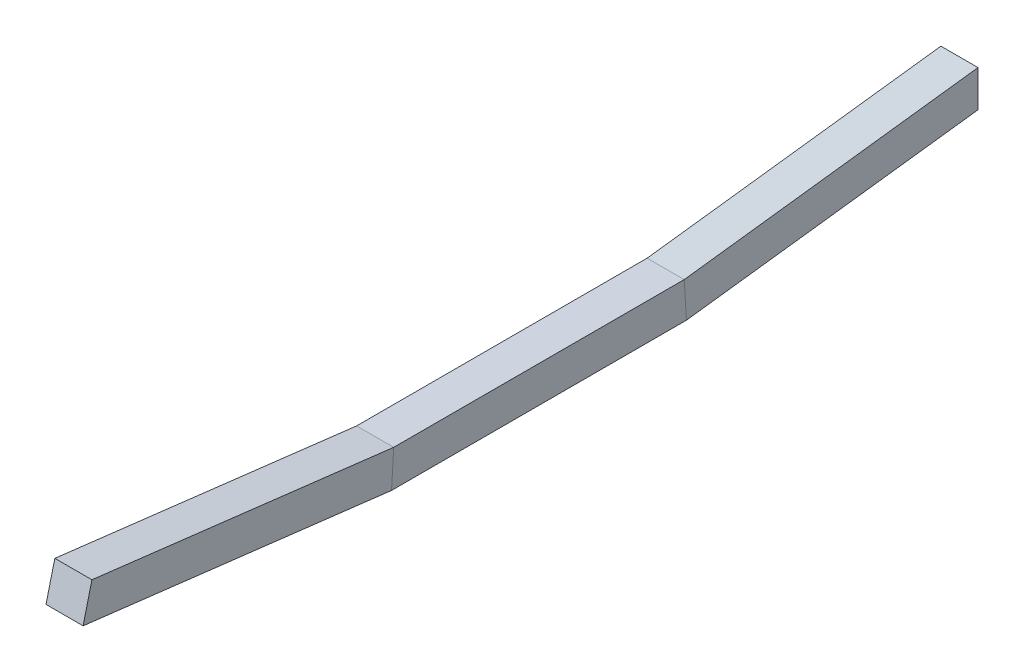
ISO-10303-21;
HEADER;
FILE_DESCRIPTION(('STEP AP214'),'2;1');
FILE_NAME('part.step','',(''),(''),'','','');
FILE_SCHEMA(('AUTOMOTIVE_DESIGN { 1 0 10303 214 1 1 1 1 }'));
ENDSEC;
DATA;
#1=APPLICATION_CONTEXT('core data for automotive mechanical design processes');
#2=APPLICATION_PROTOCOL_DEFINITION('international standard','automotive_design',2000,#1);
#3=PRODUCT_CONTEXT('',#1,'mechanical');
#4=PRODUCT('Part','Part','',(#3));
#5=PRODUCT_RELATED_PRODUCT_CATEGORY('part','',(#4));
#6=PRODUCT_DEFINITION_FORMATION('','',#4);
#7=PRODUCT_DEFINITION_CONTEXT('part definition',#1,'design');
#8=PRODUCT_DEFINITION('design','',#6,#7);
#9=PRODUCT_DEFINITION_SHAPE('','',#8);
#10=(LENGTH_UNIT() NAMED_UNIT(*) SI_UNIT(.MILLI.,.METRE.));
#11=(NAMED_UNIT(*) PLANE_ANGLE_UNIT() SI_UNIT($,.RADIAN.));
#12=(NAMED_UNIT(*) SI_UNIT($,.STERADIAN.) SOLID_ANGLE_UNIT());
#13=UNCERTAINTY_MEASURE_WITH_UNIT(LENGTH_MEASURE(1.E-05),#10,'distance_accuracy_value','');
#14=(GEOMETRIC_REPRESENTATION_CONTEXT(3) GLOBAL_UNCERTAINTY_ASSIGNED_CONTEXT((#13)) GLOBAL_UNIT_ASSIGNED_CONTEXT((#10,
#11,#12)) REPRESENTATION_CONTEXT('',''));
#15=CARTESIAN_POINT('',(0.,0.,0.));
#16=DIRECTION('',(0.,0.,1.));
#17=DIRECTION('',(1.,0.,0.));
#18=AXIS2_PLACEMENT_3D('',#15,#16,#17);
#19=CARTESIAN_POINT('',(1.20792265079217E-10,1.20292664718136E-10,1146.65455636973));
#20=DIRECTION('',(1.03464840759755E-13,1.04902962956677E-13,0.999999999999998));
#21=DIRECTION('',(0.,-0.999999999999999,1.04902962956677E-13));
#22=AXIS2_PLACEMENT_3D('',#19,#20,#21);
#23=PLANE('',#22);
#24=DIRECTION('',(0.,0.999999999999999,-1.04902962956677E-13));
#25=VECTOR('',#24,1.);
#26=CARTESIAN_POINT('',(421.997751365492,1770.71710603681,1146.6545563695));
#27=LINE('',#26,#25);
#28=CARTESIAN_POINT('',(421.997751365492,1770.71710603681,1146.6545563695));
#29=VERTEX_POINT('',#28);
#30=CARTESIAN_POINT('',(421.997751365492,1796.11710603682,1146.6545563695));
#31=VERTEX_POINT('',#30);
#32=EDGE_CURVE('E81',#29,#31,#27,.T.);
#33=ORIENTED_EDGE('',*,*,#32,.F.);
#34=DIRECTION('',(0.999999999999999,0.,0.));
#35=VECTOR('',#34,1.);
#36=CARTESIAN_POINT('',(396.244700961757,1770.71710603681,1146.6545563695));
#37=LINE('',#36,#35);
#38=CARTESIAN_POINT('',(396.244700961757,1770.71710603681,1146.6545563695));
#39=VERTEX_POINT('',#38);
#40=EDGE_CURVE('E88',#39,#29,#37,.T.);
#41=ORIENTED_EDGE('',*,*,#40,.F.);
#42=DIRECTION('',(0.,-0.999999999999999,0.));
#43=VECTOR('',#42,1.);
#44=CARTESIAN_POINT('',(396.244700961757,1770.71710603681,1146.6545563695));
#45=LINE('',#44,#43);
#46=CARTESIAN_POINT('',(396.244700961757,1796.11710603682,1146.6545563695));
#47=VERTEX_POINT('',#46);
#48=EDGE_CURVE('E96',#47,#39,#45,.T.);
#49=ORIENTED_EDGE('',*,*,#48,.F.);
#50=DIRECTION('',(-0.999999999999999,0.,1.03464840759755E-13));
#51=VECTOR('',#50,1.);
#52=CARTESIAN_POINT('',(396.244700961757,1796.11710603682,1146.6545563695));
#53=LINE('',#52,#51);
#54=EDGE_CURVE('E98',#31,#47,#53,.T.);
#55=ORIENTED_EDGE('',*,*,#54,.F.);
#56=EDGE_LOOP('',(#33,#41,#49,#55));
#57=FACE_BOUND('',#56,.T.);
#58=ADVANCED_FACE('F34',(#57),#23,.F.);
#59=CARTESIAN_POINT('',(1.19904086659517E-10,52.690526553056,2195.20189414131));
#60=DIRECTION('',(1.03149637491259E-13,0.241280985912597,0.970455298216791));
#61=DIRECTION('',(0.,-0.970455298216793,0.241280985912596));
#62=AXIS2_PLACEMENT_3D('',#59,#60,#61);
#63=PLANE('',#62);
#64=DIRECTION('',(0.,0.970455298216793,-0.241280985912596));
#65=VECTOR('',#64,1.);
#66=CARTESIAN_POINT('',(421.997751365491,1771.09232374946,1767.96152502444));
#67=LINE('',#66,#65);
#68=CARTESIAN_POINT('',(421.997751365491,1771.09232374946,1767.96152502444));
#69=VERTEX_POINT('',#68);
#70=CARTESIAN_POINT('',(421.997751365492,1795.74188832417,1761.83298798226));
#71=VERTEX_POINT('',#70);
#72=EDGE_CURVE('E133',#69,#71,#67,.T.);
#73=ORIENTED_EDGE('',*,*,#72,.T.);
#74=DIRECTION('',(-1.,0.,1.00147826895067E-13));
#75=VECTOR('',#74,1.);
#76=CARTESIAN_POINT('',(396.244700961758,1795.74188832417,1761.83298798227));
#77=LINE('',#76,#75);
#78=CARTESIAN_POINT('',(396.244700961758,1795.74188832417,1761.83298798227));
#79=VERTEX_POINT('',#78);
#80=EDGE_CURVE('E149',#71,#79,#77,.T.);
#81=ORIENTED_EDGE('',*,*,#80,.T.);
#82=DIRECTION('',(0.,-0.970455298216819,0.241280985912495));
#83=VECTOR('',#82,1.);
#84=CARTESIAN_POINT('',(396.244700961756,1771.09232374946,1767.96152502444));
#85=LINE('',#84,#83);
#86=CARTESIAN_POINT('',(396.244700961756,1771.09232374946,1767.96152502444));
#87=VERTEX_POINT('',#86);
#88=EDGE_CURVE('E143',#79,#87,#85,.T.);
#89=ORIENTED_EDGE('',*,*,#88,.T.);
#90=DIRECTION('',(0.999999999999999,0.,0.));
#91=VECTOR('',#90,1.);
#92=CARTESIAN_POINT('',(396.244700961756,1771.09232374946,1767.96152502444));
#93=LINE('',#92,#91);
#94=EDGE_CURVE('E139',#87,#69,#93,.T.);
#95=ORIENTED_EDGE('',*,*,#94,.T.);
#96=EDGE_LOOP('',(#73,#81,#89,#95));
#97=FACE_BOUND('',#96,.T.);
#98=ADVANCED_FACE('F198',(#97),#63,.T.);
#99=CARTESIAN_POINT('',(421.997751365491,1745.19682450104,1350.81680865566));
#100=DIRECTION('',(-0.999999999999999,0.,0.));
#101=DIRECTION('',(0.,0.,0.999999999999998));
#102=AXIS2_PLACEMENT_3D('',#99,#100,#101);
#103=PLANE('',#102);
#104=DIRECTION('',(0.,-0.99806760209759,-0.0621374415563258));
#105=VECTOR('',#104,1.);
#106=CARTESIAN_POINT('',(421.997751365493,1758.22576367982,1349.86754692452));
#107=LINE('',#106,#105);
#108=CARTESIAN_POINT('',(421.997751365492,1770.61903507108,1350.6391240954));
#109=VERTEX_POINT('',#108);
#110=CARTESIAN_POINT('',(421.997751365491,1745.41517700255,1349.06998864361));
#111=VERTEX_POINT('',#110);
#112=EDGE_CURVE('E102',#109,#111,#107,.T.);
#113=ORIENTED_EDGE('',*,*,#112,.T.);
#114=DIRECTION('',(0.,0.124034734589205,-0.992277876713666));
#115=VECTOR('',#114,1.);
#116=CARTESIAN_POINT('',(421.997751365491,1745.19682450104,1350.81680865566));
#117=LINE('',#116,#115);
#118=EDGE_CURVE('E37',#111,#29,#117,.T.);
#119=ORIENTED_EDGE('',*,*,#118,.T.);
#120=ORIENTED_EDGE('',*,*,#32,.T.);
#121=DIRECTION('',(0.,0.124034734589205,-0.992277876713666));
#122=VECTOR('',#121,1.);
#123=CARTESIAN_POINT('',(421.997751365491,1770.59682450105,1350.81680865566));
#124=LINE('',#123,#122);
#125=EDGE_CURVE('E105',#109,#31,#124,.T.);
#126=ORIENTED_EDGE('',*,*,#125,.F.);
#127=EDGE_LOOP('',(#113,#119,#120,#126));
#128=FACE_BOUND('',#127,.T.);
#129=ADVANCED_FACE('F101',(#128),#103,.F.);
#130=CARTESIAN_POINT('',(396.244700961756,1770.59682450105,1350.81680865566));
#131=DIRECTION('',(0.,-0.992277876713668,-0.124034734589205));
#132=DIRECTION('',(0.,0.124034734589205,-0.992277876713666));
#133=AXIS2_PLACEMENT_3D('',#130,#131,#132);
#134=PLANE('',#133);
#135=DIRECTION('',(1.,0.,0.));
#136=VECTOR('',#135,1.);
#137=CARTESIAN_POINT('',(396.244700961756,1770.61903507108,1350.6391240954));
#138=LINE('',#137,#136);
#139=CARTESIAN_POINT('',(396.244700961756,1770.61903507108,1350.6391240954));
#140=VERTEX_POINT('',#139);
#141=EDGE_CURVE('E131',#140,#109,#138,.T.);
#142=ORIENTED_EDGE('',*,*,#141,.T.);
#143=ORIENTED_EDGE('',*,*,#125,.T.);
#144=ORIENTED_EDGE('',*,*,#54,.T.);
#145=DIRECTION('',(0.,0.124034734589205,-0.992277876713666));
#146=VECTOR('',#145,1.);
#147=CARTESIAN_POINT('',(396.244700961756,1770.59682450105,1350.81680865566));
#148=LINE('',#147,#146);
#149=EDGE_CURVE('E109',#140,#47,#148,.T.);
#150=ORIENTED_EDGE('',*,*,#149,.F.);
#151=EDGE_LOOP('',(#142,#143,#144,#150));
#152=FACE_BOUND('',#151,.T.);
#153=ADVANCED_FACE('F204',(#152),#134,.F.);
#154=CARTESIAN_POINT('',(396.244700961757,1745.19682450104,1350.81680865566));
#155=DIRECTION('',(0.999999999999999,0.,0.));
#156=DIRECTION('',(0.,0.,-0.999999999999998));
#157=AXIS2_PLACEMENT_3D('',#154,#155,#156);
#158=PLANE('',#157);
#159=DIRECTION('',(0.,0.99806760209759,0.0621374415563258));
#160=VECTOR('',#159,1.);
#161=CARTESIAN_POINT('',(396.244700961758,1758.22576367982,1349.86754692452));
#162=LINE('',#161,#160);
#163=CARTESIAN_POINT('',(396.244700961756,1745.41517700255,1349.06998864361));
#164=VERTEX_POINT('',#163);
#165=EDGE_CURVE('E128',#164,#140,#162,.T.);
#166=ORIENTED_EDGE('',*,*,#165,.T.);
#167=ORIENTED_EDGE('',*,*,#149,.T.);
#168=ORIENTED_EDGE('',*,*,#48,.T.);
#169=DIRECTION('',(0.,0.124034734589205,-0.992277876713666));
#170=VECTOR('',#169,1.);
#171=CARTESIAN_POINT('',(396.244700961757,1745.19682450104,1350.81680865566));
#172=LINE('',#171,#170);
#173=EDGE_CURVE('E93',#164,#39,#172,.T.);
#174=ORIENTED_EDGE('',*,*,#173,.F.);
#175=EDGE_LOOP('',(#166,#167,#168,#174));
#176=FACE_BOUND('',#175,.T.);
#177=ADVANCED_FACE('F230',(#176),#158,.F.);
#178=CARTESIAN_POINT('',(396.244700961757,1745.19682450104,1350.81680865566));
#179=DIRECTION('',(0.,0.992277876713667,0.124034734589205));
#180=DIRECTION('',(0.,-0.124034734589205,0.992277876713666));
#181=AXIS2_PLACEMENT_3D('',#178,#179,#180);
#182=PLANE('',#181);
#183=DIRECTION('',(-0.999999999999999,0.,0.));
#184=VECTOR('',#183,1.);
#185=CARTESIAN_POINT('',(396.244700961756,1745.41517700255,1349.06998864361));
#186=LINE('',#185,#184);
#187=EDGE_CURVE('E119',#111,#164,#186,.T.);
#188=ORIENTED_EDGE('',*,*,#187,.T.);
#189=ORIENTED_EDGE('',*,*,#173,.T.);
#190=ORIENTED_EDGE('',*,*,#40,.T.);
#191=ORIENTED_EDGE('',*,*,#118,.F.);
#192=EDGE_LOOP('',(#188,#189,#190,#191));
#193=FACE_BOUND('',#192,.T.);
#194=ADVANCED_FACE('F90',(#193),#182,.F.);
#195=CARTESIAN_POINT('',(396.244700961756,1745.41517700255,1555.63449204177));
#196=DIRECTION('',(0.,0.999999999999999,0.));
#197=DIRECTION('',(0.,0.,0.999999999999998));
#198=AXIS2_PLACEMENT_3D('',#195,#196,#197);
#199=PLANE('',#198);
#200=DIRECTION('',(0.,0.,-0.999999999999998));
#201=VECTOR('',#200,1.);
#202=CARTESIAN_POINT('',(421.997751365491,1745.41517700255,1555.63449204177));
#203=LINE('',#202,#201);
#204=CARTESIAN_POINT('',(421.997751365491,1745.41517700255,1553.80734791427));
#205=VERTEX_POINT('',#204);
#206=EDGE_CURVE('E120',#205,#111,#203,.T.);
#207=ORIENTED_EDGE('',*,*,#206,.F.);
#208=DIRECTION('',(-0.999999999999999,0.,0.));
#209=VECTOR('',#208,1.);
#210=CARTESIAN_POINT('',(396.244700961756,1745.41517700255,1553.80734791427));
#211=LINE('',#210,#209);
#212=CARTESIAN_POINT('',(396.244700961756,1745.41517700255,1553.80734791427));
#213=VERTEX_POINT('',#212);
#214=EDGE_CURVE('E137',#205,#213,#211,.T.);
#215=ORIENTED_EDGE('',*,*,#214,.T.);
#216=DIRECTION('',(0.,0.,-0.999999999999998));
#217=VECTOR('',#216,1.);
#218=CARTESIAN_POINT('',(396.244700961756,1745.41517700255,1555.63449204177));
#219=LINE('',#218,#217);
#220=EDGE_CURVE('E104',#213,#164,#219,.T.);
#221=ORIENTED_EDGE('',*,*,#220,.T.);
#222=ORIENTED_EDGE('',*,*,#187,.F.);
#223=EDGE_LOOP('',(#207,#215,#221,#222));
#224=FACE_BOUND('',#223,.T.);
#225=ADVANCED_FACE('F189',(#224),#199,.F.);
#226=CARTESIAN_POINT('',(396.244700961756,1745.41517700255,1555.63449204177));
#227=DIRECTION('',(0.999999999999999,0.,0.));
#228=DIRECTION('',(0.,0.,-0.999999999999998));
#229=AXIS2_PLACEMENT_3D('',#226,#227,#228);
#230=PLANE('',#229);
#231=ORIENTED_EDGE('',*,*,#220,.F.);
#232=DIRECTION('',(0.,0.998220553236907,-0.0596299177880026));
#233=VECTOR('',#232,1.);
#234=CARTESIAN_POINT('',(396.244700961757,1758.253750376,1553.04042013233));
#235=LINE('',#234,#233);
#236=CARTESIAN_POINT('',(396.244700961756,1770.61903507108,1552.30176482474));
#237=VERTEX_POINT('',#236);
#238=EDGE_CURVE('E43',#213,#237,#235,.T.);
#239=ORIENTED_EDGE('',*,*,#238,.T.);
#240=DIRECTION('',(0.,0.,-0.999999999999998));
#241=VECTOR('',#240,1.);
#242=CARTESIAN_POINT('',(396.244700961756,1770.61903507108,1552.4840097832));
#243=LINE('',#242,#241);
#244=EDGE_CURVE('E107',#237,#140,#243,.T.);
#245=ORIENTED_EDGE('',*,*,#244,.T.);
#246=ORIENTED_EDGE('',*,*,#165,.F.);
#247=EDGE_LOOP('',(#231,#239,#245,#246));
#248=FACE_BOUND('',#247,.T.);
#249=ADVANCED_FACE('F165',(#248),#230,.F.);
#250=CARTESIAN_POINT('',(396.244700961756,1770.61903507108,1552.4840097832));
#251=DIRECTION('',(0.,-1.,0.));
#252=DIRECTION('',(1.,0.,0.));
#253=AXIS2_PLACEMENT_3D('',#250,#251,#252);
#254=PLANE('',#253);
#255=ORIENTED_EDGE('',*,*,#244,.F.);
#256=DIRECTION('',(1.,0.,0.));
#257=VECTOR('',#256,1.);
#258=CARTESIAN_POINT('',(396.244700961755,1770.61903507108,1552.30176482474));
#259=LINE('',#258,#257);
#260=CARTESIAN_POINT('',(421.997751365491,1770.61903507108,1552.30176482474));
#261=VERTEX_POINT('',#260);
#262=EDGE_CURVE('E11',#237,#261,#259,.T.);
#263=ORIENTED_EDGE('',*,*,#262,.T.);
#264=DIRECTION('',(0.,0.,-0.999999999999998));
#265=VECTOR('',#264,1.);
#266=CARTESIAN_POINT('',(421.997751365491,1770.61903507108,1552.4840097832));
#267=LINE('',#266,#265);
#268=EDGE_CURVE('E122',#261,#109,#267,.T.);
#269=ORIENTED_EDGE('',*,*,#268,.T.);
#270=ORIENTED_EDGE('',*,*,#141,.F.);
#271=EDGE_LOOP('',(#255,#263,#269,#270));
#272=FACE_BOUND('',#271,.T.);
#273=ADVANCED_FACE('F220',(#272),#254,.F.);
#274=CARTESIAN_POINT('',(421.997751365491,1745.41517700255,1555.63449204177));
#275=DIRECTION('',(-0.999999999999999,0.,0.));
#276=DIRECTION('',(0.,0.,0.999999999999998));
#277=AXIS2_PLACEMENT_3D('',#274,#275,#276);
#278=PLANE('',#277);
#279=ORIENTED_EDGE('',*,*,#268,.F.);
#280=DIRECTION('',(0.,-0.998220553236907,0.0596299177880026));
#281=VECTOR('',#280,1.);
#282=CARTESIAN_POINT('',(421.997751365491,1758.253750376,1553.04042013233));
#283=LINE('',#282,#281);
#284=EDGE_CURVE('E134',#261,#205,#283,.T.);
#285=ORIENTED_EDGE('',*,*,#284,.T.);
#286=ORIENTED_EDGE('',*,*,#206,.T.);
#287=ORIENTED_EDGE('',*,*,#112,.F.);
#288=EDGE_LOOP('',(#279,#285,#286,#287));
#289=FACE_BOUND('',#288,.T.);
#290=ADVANCED_FACE('F192',(#289),#278,.F.);
#291=CARTESIAN_POINT('',(396.244700961756,1771.09232374946,1767.96152502444));
#292=DIRECTION('',(0.,0.992888545809192,-0.11904761904762));
#293=DIRECTION('',(0.,0.11904761904762,0.99288854580919));
#294=AXIS2_PLACEMENT_3D('',#291,#292,#293);
#295=PLANE('',#294);
#296=DIRECTION('',(0.,-0.11904761904762,-0.99288854580919));
#297=VECTOR('',#296,1.);
#298=CARTESIAN_POINT('',(421.997751365491,1771.09232374946,1767.96152502444));
#299=LINE('',#298,#297);
#300=EDGE_CURVE('E142',#69,#205,#299,.T.);
#301=ORIENTED_EDGE('',*,*,#300,.F.);
#302=ORIENTED_EDGE('',*,*,#94,.F.);
#303=DIRECTION('',(0.,-0.11904761904762,-0.99288854580919));
#304=VECTOR('',#303,1.);
#305=CARTESIAN_POINT('',(396.244700961756,1771.09232374946,1767.96152502444));
#306=LINE('',#305,#304);
#307=EDGE_CURVE('E138',#87,#213,#306,.T.);
#308=ORIENTED_EDGE('',*,*,#307,.T.);
#309=ORIENTED_EDGE('',*,*,#214,.F.);
#310=EDGE_LOOP('',(#301,#302,#308,#309));
#311=FACE_BOUND('',#310,.T.);
#312=ADVANCED_FACE('F187',(#311),#295,.F.);
#313=CARTESIAN_POINT('',(396.244700961756,1771.09232374946,1767.96152502444));
#314=DIRECTION('',(0.999999999999999,0.,0.));
#315=DIRECTION('',(0.,0.,-0.999999999999998));
#316=AXIS2_PLACEMENT_3D('',#313,#314,#315);
#317=PLANE('',#316);
#318=ORIENTED_EDGE('',*,*,#307,.F.);
#319=ORIENTED_EDGE('',*,*,#88,.F.);
#320=DIRECTION('',(0.,-0.11904761904762,-0.99288854580919));
#321=VECTOR('',#320,1.);
#322=CARTESIAN_POINT('',(396.244700961758,1795.74188832417,1761.83298798227));
#323=LINE('',#322,#321);
#324=EDGE_CURVE('E146',#79,#237,#323,.T.);
#325=ORIENTED_EDGE('',*,*,#324,.T.);
#326=ORIENTED_EDGE('',*,*,#238,.F.);
#327=EDGE_LOOP('',(#318,#319,#325,#326));
#328=FACE_BOUND('',#327,.T.);
#329=ADVANCED_FACE('F169',(#328),#317,.F.);
#330=CARTESIAN_POINT('',(396.244700961758,1795.74188832417,1761.83298798227));
#331=DIRECTION('',(0.,-0.992888545809194,0.11904761904762));
#332=DIRECTION('',(0.,-0.11904761904762,-0.99288854580919));
#333=AXIS2_PLACEMENT_3D('',#330,#331,#332);
#334=PLANE('',#333);
#335=ORIENTED_EDGE('',*,*,#324,.F.);
#336=ORIENTED_EDGE('',*,*,#80,.F.);
#337=DIRECTION('',(0.,-0.11904761904762,-0.99288854580919));
#338=VECTOR('',#337,1.);
#339=CARTESIAN_POINT('',(421.997751365492,1795.74188832417,1761.83298798226));
#340=LINE('',#339,#338);
#341=EDGE_CURVE('E152',#71,#261,#340,.T.);
#342=ORIENTED_EDGE('',*,*,#341,.T.);
#343=ORIENTED_EDGE('',*,*,#262,.F.);
#344=EDGE_LOOP('',(#335,#336,#342,#343));
#345=FACE_BOUND('',#344,.T.);
#346=ADVANCED_FACE('F172',(#345),#334,.F.);
#347=CARTESIAN_POINT('',(421.997751365491,1771.09232374946,1767.96152502444));
#348=DIRECTION('',(-0.999999999999999,0.,0.));
#349=DIRECTION('',(0.,0.,0.999999999999998));
#350=AXIS2_PLACEMENT_3D('',#347,#348,#349);
#351=PLANE('',#350);
#352=ORIENTED_EDGE('',*,*,#341,.F.);
#353=ORIENTED_EDGE('',*,*,#72,.F.);
#354=ORIENTED_EDGE('',*,*,#300,.T.);
#355=ORIENTED_EDGE('',*,*,#284,.F.);
#356=EDGE_LOOP('',(#352,#353,#354,#355));
#357=FACE_BOUND('',#356,.T.);
#358=ADVANCED_FACE('F196',(#357),#351,.F.);
#359=CLOSED_SHELL('',(#58,#98,#129,#153,#177,#194,#225,#249,#273,#290,#312,#329,#346,#358));
#360=MANIFOLD_SOLID_BREP('B2',#359);
#361=ADVANCED_BREP_SHAPE_REPRESENTATION('',(#18,#360),#14);
#362=SHAPE_DEFINITION_REPRESENTATION(#9,#361);
ENDSEC;
END-ISO-10303-21;
